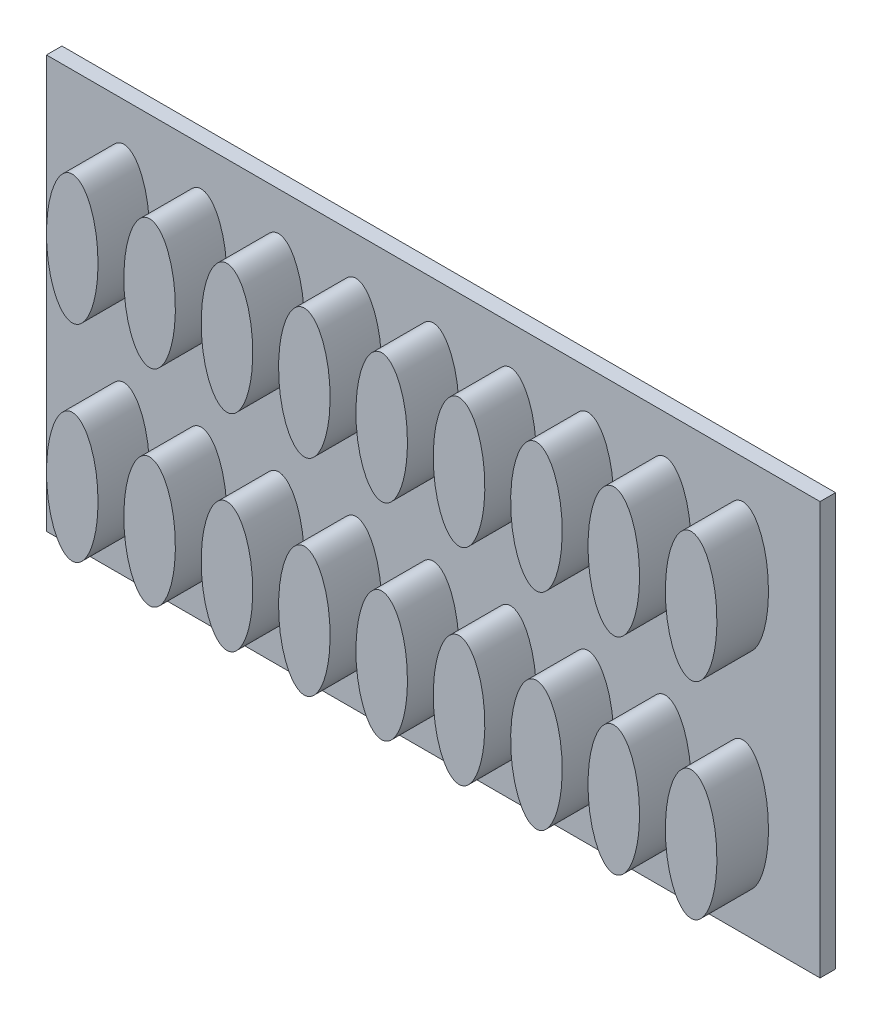
ISO-10303-21;
HEADER;
FILE_DESCRIPTION(('STEP AP214'),'2;1');
FILE_NAME('part.step','',(''),(''),'','','');
FILE_SCHEMA(('AUTOMOTIVE_DESIGN { 1 0 10303 214 1 1 1 1 }'));
ENDSEC;
DATA;
#1=APPLICATION_CONTEXT('core data for automotive mechanical design processes');
#2=APPLICATION_PROTOCOL_DEFINITION('international standard','automotive_design',2000,#1);
#3=PRODUCT_CONTEXT('',#1,'mechanical');
#4=PRODUCT('Part','Part','',(#3));
#5=PRODUCT_RELATED_PRODUCT_CATEGORY('part','',(#4));
#6=PRODUCT_DEFINITION_FORMATION('','',#4);
#7=PRODUCT_DEFINITION_CONTEXT('part definition',#1,'design');
#8=PRODUCT_DEFINITION('design','',#6,#7);
#9=PRODUCT_DEFINITION_SHAPE('','',#8);
#10=(LENGTH_UNIT() NAMED_UNIT(*) SI_UNIT(.MILLI.,.METRE.));
#11=(NAMED_UNIT(*) PLANE_ANGLE_UNIT() SI_UNIT($,.RADIAN.));
#12=(NAMED_UNIT(*) SI_UNIT($,.STERADIAN.) SOLID_ANGLE_UNIT());
#13=UNCERTAINTY_MEASURE_WITH_UNIT(LENGTH_MEASURE(1.E-05),#10,'distance_accuracy_value','');
#14=(GEOMETRIC_REPRESENTATION_CONTEXT(3) GLOBAL_UNCERTAINTY_ASSIGNED_CONTEXT((#13)) GLOBAL_UNIT_ASSIGNED_CONTEXT((#10,
#11,#12)) REPRESENTATION_CONTEXT('',''));
#15=CARTESIAN_POINT('',(0.,0.,0.));
#16=DIRECTION('',(0.,0.,1.));
#17=DIRECTION('',(1.,0.,0.));
#18=AXIS2_PLACEMENT_3D('',#15,#16,#17);
#19=CARTESIAN_POINT('',(0.,80.,3.));
#20=DIRECTION('',(0.,0.,-1.));
#21=DIRECTION('',(-1.,0.,0.));
#22=AXIS2_PLACEMENT_3D('',#19,#20,#21);
#23=PLANE('',#22);
#24=CARTESIAN_POINT('',(15.,60.,3.));
#25=DIRECTION('',(0.,0.,1.));
#26=DIRECTION('',(0.,1.,0.));
#27=AXIS2_PLACEMENT_3D('',#24,#25,#26);
#28=ELLIPSE('',#27,12.5,5.);
#29=CARTESIAN_POINT('',(15.,72.5,3.));
#30=VERTEX_POINT('',#29);
#31=EDGE_CURVE('E89',#30,#30,#28,.T.);
#32=ORIENTED_EDGE('',*,*,#31,.F.);
#33=EDGE_LOOP('',(#32));
#34=FACE_BOUND('',#33,.T.);
#35=DIRECTION('',(0.,-1.,0.));
#36=VECTOR('',#35,1.);
#37=CARTESIAN_POINT('',(0.,0.,3.));
#38=LINE('',#37,#36);
#39=CARTESIAN_POINT('',(0.,80.,3.));
#40=VERTEX_POINT('',#39);
#41=CARTESIAN_POINT('',(0.,0.,3.));
#42=VERTEX_POINT('',#41);
#43=EDGE_CURVE('E106',#40,#42,#38,.T.);
#44=ORIENTED_EDGE('',*,*,#43,.T.);
#45=DIRECTION('',(1.,0.,0.));
#46=VECTOR('',#45,1.);
#47=CARTESIAN_POINT('',(0.,0.,3.));
#48=LINE('',#47,#46);
#49=CARTESIAN_POINT('',(150.,0.,3.));
#50=VERTEX_POINT('',#49);
#51=EDGE_CURVE('E86',#42,#50,#48,.T.);
#52=ORIENTED_EDGE('',*,*,#51,.T.);
#53=DIRECTION('',(0.,1.,0.));
#54=VECTOR('',#53,1.);
#55=CARTESIAN_POINT('',(150.,0.,3.));
#56=LINE('',#55,#54);
#57=CARTESIAN_POINT('',(150.,80.,3.));
#58=VERTEX_POINT('',#57);
#59=EDGE_CURVE('E51',#50,#58,#56,.T.);
#60=ORIENTED_EDGE('',*,*,#59,.T.);
#61=DIRECTION('',(-1.,0.,0.));
#62=VECTOR('',#61,1.);
#63=CARTESIAN_POINT('',(0.,80.,3.));
#64=LINE('',#63,#62);
#65=EDGE_CURVE('E46',#58,#40,#64,.T.);
#66=ORIENTED_EDGE('',*,*,#65,.T.);
#67=EDGE_LOOP('',(#44,#52,#60,#66));
#68=FACE_BOUND('',#67,.T.);
#69=CARTESIAN_POINT('',(30.,60.,3.));
#70=DIRECTION('',(0.,0.,1.));
#71=DIRECTION('',(0.,1.,0.));
#72=AXIS2_PLACEMENT_3D('',#69,#70,#71);
#73=ELLIPSE('',#72,12.5,5.);
#74=CARTESIAN_POINT('',(30.,72.5,3.));
#75=VERTEX_POINT('',#74);
#76=EDGE_CURVE('E118',#75,#75,#73,.T.);
#77=ORIENTED_EDGE('',*,*,#76,.F.);
#78=EDGE_LOOP('',(#77));
#79=FACE_BOUND('',#78,.T.);
#80=CARTESIAN_POINT('',(45.,60.,3.));
#81=DIRECTION('',(0.,0.,1.));
#82=DIRECTION('',(0.,1.,0.));
#83=AXIS2_PLACEMENT_3D('',#80,#81,#82);
#84=ELLIPSE('',#83,12.5,5.);
#85=CARTESIAN_POINT('',(45.,72.5,3.));
#86=VERTEX_POINT('',#85);
#87=EDGE_CURVE('E121',#86,#86,#84,.T.);
#88=ORIENTED_EDGE('',*,*,#87,.F.);
#89=EDGE_LOOP('',(#88));
#90=FACE_BOUND('',#89,.T.);
#91=CARTESIAN_POINT('',(60.,60.,3.));
#92=DIRECTION('',(0.,0.,1.));
#93=DIRECTION('',(0.,1.,0.));
#94=AXIS2_PLACEMENT_3D('',#91,#92,#93);
#95=ELLIPSE('',#94,12.5,5.);
#96=CARTESIAN_POINT('',(60.,72.5,3.));
#97=VERTEX_POINT('',#96);
#98=EDGE_CURVE('E126',#97,#97,#95,.T.);
#99=ORIENTED_EDGE('',*,*,#98,.F.);
#100=EDGE_LOOP('',(#99));
#101=FACE_BOUND('',#100,.T.);
#102=CARTESIAN_POINT('',(75.,60.,3.));
#103=DIRECTION('',(0.,0.,1.));
#104=DIRECTION('',(0.,1.,0.));
#105=AXIS2_PLACEMENT_3D('',#102,#103,#104);
#106=ELLIPSE('',#105,12.5,5.);
#107=CARTESIAN_POINT('',(75.,72.5,3.));
#108=VERTEX_POINT('',#107);
#109=EDGE_CURVE('E152',#108,#108,#106,.T.);
#110=ORIENTED_EDGE('',*,*,#109,.F.);
#111=EDGE_LOOP('',(#110));
#112=FACE_BOUND('',#111,.T.);
#113=CARTESIAN_POINT('',(90.,60.,3.));
#114=DIRECTION('',(0.,0.,1.));
#115=DIRECTION('',(0.,1.,0.));
#116=AXIS2_PLACEMENT_3D('',#113,#114,#115);
#117=ELLIPSE('',#116,12.5,5.);
#118=CARTESIAN_POINT('',(90.,72.5,3.));
#119=VERTEX_POINT('',#118);
#120=EDGE_CURVE('E159',#119,#119,#117,.T.);
#121=ORIENTED_EDGE('',*,*,#120,.F.);
#122=EDGE_LOOP('',(#121));
#123=FACE_BOUND('',#122,.T.);
#124=CARTESIAN_POINT('',(105.,60.,3.));
#125=DIRECTION('',(0.,0.,1.));
#126=DIRECTION('',(0.,1.,0.));
#127=AXIS2_PLACEMENT_3D('',#124,#125,#126);
#128=ELLIPSE('',#127,12.5,5.);
#129=CARTESIAN_POINT('',(105.,72.5,3.));
#130=VERTEX_POINT('',#129);
#131=EDGE_CURVE('E179',#130,#130,#128,.T.);
#132=ORIENTED_EDGE('',*,*,#131,.F.);
#133=EDGE_LOOP('',(#132));
#134=FACE_BOUND('',#133,.T.);
#135=CARTESIAN_POINT('',(120.,60.,3.));
#136=DIRECTION('',(0.,0.,1.));
#137=DIRECTION('',(0.,1.,0.));
#138=AXIS2_PLACEMENT_3D('',#135,#136,#137);
#139=ELLIPSE('',#138,12.5,5.);
#140=CARTESIAN_POINT('',(120.,72.5,3.));
#141=VERTEX_POINT('',#140);
#142=EDGE_CURVE('E186',#141,#141,#139,.T.);
#143=ORIENTED_EDGE('',*,*,#142,.F.);
#144=EDGE_LOOP('',(#143));
#145=FACE_BOUND('',#144,.T.);
#146=CARTESIAN_POINT('',(135.,60.,3.));
#147=DIRECTION('',(0.,0.,1.));
#148=DIRECTION('',(0.,1.,0.));
#149=AXIS2_PLACEMENT_3D('',#146,#147,#148);
#150=ELLIPSE('',#149,12.5,5.);
#151=CARTESIAN_POINT('',(135.,72.5,3.));
#152=VERTEX_POINT('',#151);
#153=EDGE_CURVE('E206',#152,#152,#150,.T.);
#154=ORIENTED_EDGE('',*,*,#153,.F.);
#155=EDGE_LOOP('',(#154));
#156=FACE_BOUND('',#155,.T.);
#157=CARTESIAN_POINT('',(15.,20.,3.));
#158=DIRECTION('',(0.,0.,1.));
#159=DIRECTION('',(0.,1.,0.));
#160=AXIS2_PLACEMENT_3D('',#157,#158,#159);
#161=ELLIPSE('',#160,12.5,5.);
#162=CARTESIAN_POINT('',(15.,32.5,3.));
#163=VERTEX_POINT('',#162);
#164=EDGE_CURVE('E213',#163,#163,#161,.T.);
#165=ORIENTED_EDGE('',*,*,#164,.F.);
#166=EDGE_LOOP('',(#165));
#167=FACE_BOUND('',#166,.T.);
#168=CARTESIAN_POINT('',(30.,20.,3.));
#169=DIRECTION('',(0.,0.,1.));
#170=DIRECTION('',(0.,1.,0.));
#171=AXIS2_PLACEMENT_3D('',#168,#169,#170);
#172=ELLIPSE('',#171,12.5,5.);
#173=CARTESIAN_POINT('',(30.,32.5,3.));
#174=VERTEX_POINT('',#173);
#175=EDGE_CURVE('E233',#174,#174,#172,.T.);
#176=ORIENTED_EDGE('',*,*,#175,.F.);
#177=EDGE_LOOP('',(#176));
#178=FACE_BOUND('',#177,.T.);
#179=CARTESIAN_POINT('',(45.,20.,3.));
#180=DIRECTION('',(0.,0.,1.));
#181=DIRECTION('',(0.,1.,0.));
#182=AXIS2_PLACEMENT_3D('',#179,#180,#181);
#183=ELLIPSE('',#182,12.5,5.);
#184=CARTESIAN_POINT('',(45.,32.5,3.));
#185=VERTEX_POINT('',#184);
#186=EDGE_CURVE('E240',#185,#185,#183,.T.);
#187=ORIENTED_EDGE('',*,*,#186,.F.);
#188=EDGE_LOOP('',(#187));
#189=FACE_BOUND('',#188,.T.);
#190=CARTESIAN_POINT('',(60.,20.,3.));
#191=DIRECTION('',(0.,0.,1.));
#192=DIRECTION('',(0.,1.,0.));
#193=AXIS2_PLACEMENT_3D('',#190,#191,#192);
#194=ELLIPSE('',#193,12.5,5.);
#195=CARTESIAN_POINT('',(60.,32.5,3.));
#196=VERTEX_POINT('',#195);
#197=EDGE_CURVE('E260',#196,#196,#194,.T.);
#198=ORIENTED_EDGE('',*,*,#197,.F.);
#199=EDGE_LOOP('',(#198));
#200=FACE_BOUND('',#199,.T.);
#201=CARTESIAN_POINT('',(75.,20.,3.));
#202=DIRECTION('',(0.,0.,1.));
#203=DIRECTION('',(0.,1.,0.));
#204=AXIS2_PLACEMENT_3D('',#201,#202,#203);
#205=ELLIPSE('',#204,12.5,5.);
#206=CARTESIAN_POINT('',(75.,32.5,3.));
#207=VERTEX_POINT('',#206);
#208=EDGE_CURVE('E267',#207,#207,#205,.T.);
#209=ORIENTED_EDGE('',*,*,#208,.F.);
#210=EDGE_LOOP('',(#209));
#211=FACE_BOUND('',#210,.T.);
#212=CARTESIAN_POINT('',(90.,20.,3.));
#213=DIRECTION('',(0.,0.,1.));
#214=DIRECTION('',(0.,1.,0.));
#215=AXIS2_PLACEMENT_3D('',#212,#213,#214);
#216=ELLIPSE('',#215,12.5,5.);
#217=CARTESIAN_POINT('',(90.,32.5,3.));
#218=VERTEX_POINT('',#217);
#219=EDGE_CURVE('E287',#218,#218,#216,.T.);
#220=ORIENTED_EDGE('',*,*,#219,.F.);
#221=EDGE_LOOP('',(#220));
#222=FACE_BOUND('',#221,.T.);
#223=CARTESIAN_POINT('',(105.,20.,3.));
#224=DIRECTION('',(0.,0.,1.));
#225=DIRECTION('',(0.,1.,0.));
#226=AXIS2_PLACEMENT_3D('',#223,#224,#225);
#227=ELLIPSE('',#226,12.5,5.);
#228=CARTESIAN_POINT('',(105.,32.5,3.));
#229=VERTEX_POINT('',#228);
#230=EDGE_CURVE('E294',#229,#229,#227,.T.);
#231=ORIENTED_EDGE('',*,*,#230,.F.);
#232=EDGE_LOOP('',(#231));
#233=FACE_BOUND('',#232,.T.);
#234=CARTESIAN_POINT('',(120.,20.,3.));
#235=DIRECTION('',(0.,0.,1.));
#236=DIRECTION('',(0.,1.,0.));
#237=AXIS2_PLACEMENT_3D('',#234,#235,#236);
#238=ELLIPSE('',#237,12.5,5.);
#239=CARTESIAN_POINT('',(120.,32.5,3.));
#240=VERTEX_POINT('',#239);
#241=EDGE_CURVE('E314',#240,#240,#238,.T.);
#242=ORIENTED_EDGE('',*,*,#241,.F.);
#243=EDGE_LOOP('',(#242));
#244=FACE_BOUND('',#243,.T.);
#245=CARTESIAN_POINT('',(135.,20.,3.));
#246=DIRECTION('',(0.,0.,1.));
#247=DIRECTION('',(0.,1.,0.));
#248=AXIS2_PLACEMENT_3D('',#245,#246,#247);
#249=ELLIPSE('',#248,12.5,5.);
#250=CARTESIAN_POINT('',(135.,32.5,3.));
#251=VERTEX_POINT('',#250);
#252=EDGE_CURVE('E35',#251,#251,#249,.T.);
#253=ORIENTED_EDGE('',*,*,#252,.F.);
#254=EDGE_LOOP('',(#253));
#255=FACE_BOUND('',#254,.T.);
#256=ADVANCED_FACE('F31',(#34,#68,#79,#90,#101,#112,#123,#134,#145,#156,#167,#178,#189,#200,
#211,#222,#233,#244,#255),#23,.F.);
#257=CARTESIAN_POINT('',(0.,0.,3.));
#258=DIRECTION('',(1.,0.,0.));
#259=DIRECTION('',(0.,0.,-1.));
#260=AXIS2_PLACEMENT_3D('',#257,#258,#259);
#261=PLANE('',#260);
#262=DIRECTION('',(0.,-1.,0.));
#263=VECTOR('',#262,1.);
#264=CARTESIAN_POINT('',(0.,0.,0.));
#265=LINE('',#264,#263);
#266=CARTESIAN_POINT('',(0.,80.,0.));
#267=VERTEX_POINT('',#266);
#268=CARTESIAN_POINT('',(0.,0.,0.));
#269=VERTEX_POINT('',#268);
#270=EDGE_CURVE('E77',#267,#269,#265,.T.);
#271=ORIENTED_EDGE('',*,*,#270,.T.);
#272=DIRECTION('',(0.,0.,-1.));
#273=VECTOR('',#272,1.);
#274=CARTESIAN_POINT('',(0.,0.,3.));
#275=LINE('',#274,#273);
#276=EDGE_CURVE('E84',#42,#269,#275,.T.);
#277=ORIENTED_EDGE('',*,*,#276,.F.);
#278=ORIENTED_EDGE('',*,*,#43,.F.);
#279=DIRECTION('',(0.,0.,-1.));
#280=VECTOR('',#279,1.);
#281=CARTESIAN_POINT('',(0.,80.,3.));
#282=LINE('',#281,#280);
#283=EDGE_CURVE('E94',#40,#267,#282,.T.);
#284=ORIENTED_EDGE('',*,*,#283,.T.);
#285=EDGE_LOOP('',(#271,#277,#278,#284));
#286=FACE_BOUND('',#285,.T.);
#287=ADVANCED_FACE('F93',(#286),#261,.F.);
#288=CARTESIAN_POINT('',(0.,0.,3.));
#289=DIRECTION('',(0.,1.,0.));
#290=DIRECTION('',(0.,0.,1.));
#291=AXIS2_PLACEMENT_3D('',#288,#289,#290);
#292=PLANE('',#291);
#293=DIRECTION('',(1.,0.,0.));
#294=VECTOR('',#293,1.);
#295=CARTESIAN_POINT('',(0.,0.,0.));
#296=LINE('',#295,#294);
#297=CARTESIAN_POINT('',(150.,0.,0.));
#298=VERTEX_POINT('',#297);
#299=EDGE_CURVE('E72',#269,#298,#296,.T.);
#300=ORIENTED_EDGE('',*,*,#299,.T.);
#301=DIRECTION('',(0.,0.,-1.));
#302=VECTOR('',#301,1.);
#303=CARTESIAN_POINT('',(150.,0.,3.));
#304=LINE('',#303,#302);
#305=EDGE_CURVE('E90',#50,#298,#304,.T.);
#306=ORIENTED_EDGE('',*,*,#305,.F.);
#307=ORIENTED_EDGE('',*,*,#51,.F.);
#308=ORIENTED_EDGE('',*,*,#276,.T.);
#309=EDGE_LOOP('',(#300,#306,#307,#308));
#310=FACE_BOUND('',#309,.T.);
#311=ADVANCED_FACE('F85',(#310),#292,.F.);
#312=CARTESIAN_POINT('',(150.,0.,3.));
#313=DIRECTION('',(-1.,0.,0.));
#314=DIRECTION('',(0.,0.,1.));
#315=AXIS2_PLACEMENT_3D('',#312,#313,#314);
#316=PLANE('',#315);
#317=DIRECTION('',(0.,1.,0.));
#318=VECTOR('',#317,1.);
#319=CARTESIAN_POINT('',(150.,0.,0.));
#320=LINE('',#319,#318);
#321=CARTESIAN_POINT('',(150.,80.,0.));
#322=VERTEX_POINT('',#321);
#323=EDGE_CURVE('E78',#298,#322,#320,.T.);
#324=ORIENTED_EDGE('',*,*,#323,.T.);
#325=DIRECTION('',(0.,0.,-1.));
#326=VECTOR('',#325,1.);
#327=CARTESIAN_POINT('',(150.,80.,3.));
#328=LINE('',#327,#326);
#329=EDGE_CURVE('E112',#58,#322,#328,.T.);
#330=ORIENTED_EDGE('',*,*,#329,.F.);
#331=ORIENTED_EDGE('',*,*,#59,.F.);
#332=ORIENTED_EDGE('',*,*,#305,.T.);
#333=EDGE_LOOP('',(#324,#330,#331,#332));
#334=FACE_BOUND('',#333,.T.);
#335=ADVANCED_FACE('F350',(#334),#316,.F.);
#336=CARTESIAN_POINT('',(0.,80.,3.));
#337=DIRECTION('',(0.,-1.,0.));
#338=DIRECTION('',(0.,0.,-1.));
#339=AXIS2_PLACEMENT_3D('',#336,#337,#338);
#340=PLANE('',#339);
#341=DIRECTION('',(-1.,0.,0.));
#342=VECTOR('',#341,1.);
#343=CARTESIAN_POINT('',(0.,80.,0.));
#344=LINE('',#343,#342);
#345=EDGE_CURVE('E104',#322,#267,#344,.T.);
#346=ORIENTED_EDGE('',*,*,#345,.T.);
#347=ORIENTED_EDGE('',*,*,#283,.F.);
#348=ORIENTED_EDGE('',*,*,#65,.F.);
#349=ORIENTED_EDGE('',*,*,#329,.T.);
#350=EDGE_LOOP('',(#346,#347,#348,#349));
#351=FACE_BOUND('',#350,.T.);
#352=ADVANCED_FACE('F347',(#351),#340,.F.);
#353=CARTESIAN_POINT('',(0.,80.,0.));
#354=DIRECTION('',(0.,0.,-1.));
#355=DIRECTION('',(-1.,0.,0.));
#356=AXIS2_PLACEMENT_3D('',#353,#354,#355);
#357=PLANE('',#356);
#358=ORIENTED_EDGE('',*,*,#270,.F.);
#359=ORIENTED_EDGE('',*,*,#345,.F.);
#360=ORIENTED_EDGE('',*,*,#323,.F.);
#361=ORIENTED_EDGE('',*,*,#299,.F.);
#362=EDGE_LOOP('',(#358,#359,#360,#361));
#363=FACE_BOUND('',#362,.T.);
#364=ADVANCED_FACE('F74',(#363),#357,.T.);
#365=CARTESIAN_POINT('',(15.,60.,13.));
#366=DIRECTION('',(0.,0.,1.));
#367=DIRECTION('',(0.,1.,0.));
#368=AXIS2_PLACEMENT_3D('',#365,#366,#367);
#369=ELLIPSE('',#368,12.5,5.);
#370=DIRECTION('',(0.,0.,-1.));
#371=VECTOR('',#370,1.);
#372=SURFACE_OF_LINEAR_EXTRUSION('',#369,#371);
#373=CARTESIAN_POINT('',(15.,72.5,13.));
#374=VERTEX_POINT('',#373);
#375=EDGE_CURVE('E95',#374,#374,#369,.T.);
#376=ORIENTED_EDGE('',*,*,#375,.F.);
#377=EDGE_LOOP('',(#376));
#378=FACE_BOUND('',#377,.T.);
#379=ORIENTED_EDGE('',*,*,#31,.T.);
#380=EDGE_LOOP('',(#379));
#381=FACE_BOUND('',#380,.T.);
#382=ADVANCED_FACE('F373',(#378,#381),#372,.F.);
#383=CARTESIAN_POINT('',(15.,60.,13.));
#384=DIRECTION('',(0.,0.,1.));
#385=DIRECTION('',(1.,0.,0.));
#386=AXIS2_PLACEMENT_3D('',#383,#384,#385);
#387=PLANE('',#386);
#388=ORIENTED_EDGE('',*,*,#375,.T.);
#389=EDGE_LOOP('',(#388));
#390=FACE_BOUND('',#389,.T.);
#391=ADVANCED_FACE('F379',(#390),#387,.T.);
#392=CARTESIAN_POINT('',(30.,60.,13.));
#393=DIRECTION('',(0.,0.,1.));
#394=DIRECTION('',(0.,1.,0.));
#395=AXIS2_PLACEMENT_3D('',#392,#393,#394);
#396=ELLIPSE('',#395,12.5,5.);
#397=DIRECTION('',(0.,0.,-1.));
#398=VECTOR('',#397,1.);
#399=SURFACE_OF_LINEAR_EXTRUSION('',#396,#398);
#400=CARTESIAN_POINT('',(30.,72.5,13.));
#401=VERTEX_POINT('',#400);
#402=EDGE_CURVE('E98',#401,#401,#396,.T.);
#403=ORIENTED_EDGE('',*,*,#402,.F.);
#404=EDGE_LOOP('',(#403));
#405=FACE_BOUND('',#404,.T.);
#406=ORIENTED_EDGE('',*,*,#76,.T.);
#407=EDGE_LOOP('',(#406));
#408=FACE_BOUND('',#407,.T.);
#409=ADVANCED_FACE('F141',(#405,#408),#399,.F.);
#410=CARTESIAN_POINT('',(30.,60.,13.));
#411=DIRECTION('',(0.,0.,1.));
#412=DIRECTION('',(1.,0.,0.));
#413=AXIS2_PLACEMENT_3D('',#410,#411,#412);
#414=PLANE('',#413);
#415=ORIENTED_EDGE('',*,*,#402,.T.);
#416=EDGE_LOOP('',(#415));
#417=FACE_BOUND('',#416,.T.);
#418=ADVANCED_FACE('F139',(#417),#414,.T.);
#419=CARTESIAN_POINT('',(45.,60.,13.));
#420=DIRECTION('',(0.,0.,1.));
#421=DIRECTION('',(1.,0.,0.));
#422=AXIS2_PLACEMENT_3D('',#419,#420,#421);
#423=PLANE('',#422);
#424=CARTESIAN_POINT('',(45.,60.,13.));
#425=DIRECTION('',(0.,0.,1.));
#426=DIRECTION('',(0.,1.,0.));
#427=AXIS2_PLACEMENT_3D('',#424,#425,#426);
#428=ELLIPSE('',#427,12.5,5.);
#429=CARTESIAN_POINT('',(45.,72.5,13.));
#430=VERTEX_POINT('',#429);
#431=EDGE_CURVE('E122',#430,#430,#428,.T.);
#432=ORIENTED_EDGE('',*,*,#431,.T.);
#433=EDGE_LOOP('',(#432));
#434=FACE_BOUND('',#433,.T.);
#435=ADVANCED_FACE('F134',(#434),#423,.T.);
#436=DIRECTION('',(0.,0.,-1.));
#437=VECTOR('',#436,1.);
#438=SURFACE_OF_LINEAR_EXTRUSION('',#428,#437);
#439=ORIENTED_EDGE('',*,*,#431,.F.);
#440=EDGE_LOOP('',(#439));
#441=FACE_BOUND('',#440,.T.);
#442=ORIENTED_EDGE('',*,*,#87,.T.);
#443=EDGE_LOOP('',(#442));
#444=FACE_BOUND('',#443,.T.);
#445=ADVANCED_FACE('F129',(#441,#444),#438,.F.);
#446=CARTESIAN_POINT('',(60.,60.,13.));
#447=DIRECTION('',(0.,0.,1.));
#448=DIRECTION('',(1.,0.,0.));
#449=AXIS2_PLACEMENT_3D('',#446,#447,#448);
#450=PLANE('',#449);
#451=CARTESIAN_POINT('',(60.,60.,13.));
#452=DIRECTION('',(0.,0.,1.));
#453=DIRECTION('',(0.,1.,0.));
#454=AXIS2_PLACEMENT_3D('',#451,#452,#453);
#455=ELLIPSE('',#454,12.5,5.);
#456=CARTESIAN_POINT('',(60.,72.5,13.));
#457=VERTEX_POINT('',#456);
#458=EDGE_CURVE('E148',#457,#457,#455,.T.);
#459=ORIENTED_EDGE('',*,*,#458,.T.);
#460=EDGE_LOOP('',(#459));
#461=FACE_BOUND('',#460,.T.);
#462=ADVANCED_FACE('F133',(#461),#450,.T.);
#463=DIRECTION('',(0.,0.,-1.));
#464=VECTOR('',#463,1.);
#465=SURFACE_OF_LINEAR_EXTRUSION('',#455,#464);
#466=ORIENTED_EDGE('',*,*,#458,.F.);
#467=EDGE_LOOP('',(#466));
#468=FACE_BOUND('',#467,.T.);
#469=ORIENTED_EDGE('',*,*,#98,.T.);
#470=EDGE_LOOP('',(#469));
#471=FACE_BOUND('',#470,.T.);
#472=ADVANCED_FACE('F142',(#468,#471),#465,.F.);
#473=CARTESIAN_POINT('',(75.,60.,13.));
#474=DIRECTION('',(0.,0.,1.));
#475=DIRECTION('',(1.,0.,0.));
#476=AXIS2_PLACEMENT_3D('',#473,#474,#475);
#477=PLANE('',#476);
#478=CARTESIAN_POINT('',(75.,60.,13.));
#479=DIRECTION('',(0.,0.,1.));
#480=DIRECTION('',(0.,1.,0.));
#481=AXIS2_PLACEMENT_3D('',#478,#479,#480);
#482=ELLIPSE('',#481,12.5,5.);
#483=CARTESIAN_POINT('',(75.,72.5,13.));
#484=VERTEX_POINT('',#483);
#485=EDGE_CURVE('E155',#484,#484,#482,.T.);
#486=ORIENTED_EDGE('',*,*,#485,.T.);
#487=EDGE_LOOP('',(#486));
#488=FACE_BOUND('',#487,.T.);
#489=ADVANCED_FACE('F145',(#488),#477,.T.);
#490=DIRECTION('',(0.,0.,-1.));
#491=VECTOR('',#490,1.);
#492=SURFACE_OF_LINEAR_EXTRUSION('',#482,#491);
#493=ORIENTED_EDGE('',*,*,#485,.F.);
#494=EDGE_LOOP('',(#493));
#495=FACE_BOUND('',#494,.T.);
#496=ORIENTED_EDGE('',*,*,#109,.T.);
#497=EDGE_LOOP('',(#496));
#498=FACE_BOUND('',#497,.T.);
#499=ADVANCED_FACE('F161',(#495,#498),#492,.F.);
#500=CARTESIAN_POINT('',(90.,60.,13.));
#501=DIRECTION('',(0.,0.,1.));
#502=DIRECTION('',(1.,0.,0.));
#503=AXIS2_PLACEMENT_3D('',#500,#501,#502);
#504=PLANE('',#503);
#505=CARTESIAN_POINT('',(90.,60.,13.));
#506=DIRECTION('',(0.,0.,1.));
#507=DIRECTION('',(0.,1.,0.));
#508=AXIS2_PLACEMENT_3D('',#505,#506,#507);
#509=ELLIPSE('',#508,12.5,5.);
#510=CARTESIAN_POINT('',(90.,72.5,13.));
#511=VERTEX_POINT('',#510);
#512=EDGE_CURVE('E175',#511,#511,#509,.T.);
#513=ORIENTED_EDGE('',*,*,#512,.T.);
#514=EDGE_LOOP('',(#513));
#515=FACE_BOUND('',#514,.T.);
#516=ADVANCED_FACE('F164',(#515),#504,.T.);
#517=DIRECTION('',(0.,0.,-1.));
#518=VECTOR('',#517,1.);
#519=SURFACE_OF_LINEAR_EXTRUSION('',#509,#518);
#520=ORIENTED_EDGE('',*,*,#512,.F.);
#521=EDGE_LOOP('',(#520));
#522=FACE_BOUND('',#521,.T.);
#523=ORIENTED_EDGE('',*,*,#120,.T.);
#524=EDGE_LOOP('',(#523));
#525=FACE_BOUND('',#524,.T.);
#526=ADVANCED_FACE('F169',(#522,#525),#519,.F.);
#527=CARTESIAN_POINT('',(105.,60.,13.));
#528=DIRECTION('',(0.,0.,1.));
#529=DIRECTION('',(1.,0.,0.));
#530=AXIS2_PLACEMENT_3D('',#527,#528,#529);
#531=PLANE('',#530);
#532=CARTESIAN_POINT('',(105.,60.,13.));
#533=DIRECTION('',(0.,0.,1.));
#534=DIRECTION('',(0.,1.,0.));
#535=AXIS2_PLACEMENT_3D('',#532,#533,#534);
#536=ELLIPSE('',#535,12.5,5.);
#537=CARTESIAN_POINT('',(105.,72.5,13.));
#538=VERTEX_POINT('',#537);
#539=EDGE_CURVE('E182',#538,#538,#536,.T.);
#540=ORIENTED_EDGE('',*,*,#539,.T.);
#541=EDGE_LOOP('',(#540));
#542=FACE_BOUND('',#541,.T.);
#543=ADVANCED_FACE('F172',(#542),#531,.T.);
#544=DIRECTION('',(0.,0.,-1.));
#545=VECTOR('',#544,1.);
#546=SURFACE_OF_LINEAR_EXTRUSION('',#536,#545);
#547=ORIENTED_EDGE('',*,*,#539,.F.);
#548=EDGE_LOOP('',(#547));
#549=FACE_BOUND('',#548,.T.);
#550=ORIENTED_EDGE('',*,*,#131,.T.);
#551=EDGE_LOOP('',(#550));
#552=FACE_BOUND('',#551,.T.);
#553=ADVANCED_FACE('F188',(#549,#552),#546,.F.);
#554=CARTESIAN_POINT('',(120.,60.,13.));
#555=DIRECTION('',(0.,0.,1.));
#556=DIRECTION('',(1.,0.,0.));
#557=AXIS2_PLACEMENT_3D('',#554,#555,#556);
#558=PLANE('',#557);
#559=CARTESIAN_POINT('',(120.,60.,13.));
#560=DIRECTION('',(0.,0.,1.));
#561=DIRECTION('',(0.,1.,0.));
#562=AXIS2_PLACEMENT_3D('',#559,#560,#561);
#563=ELLIPSE('',#562,12.5,5.);
#564=CARTESIAN_POINT('',(120.,72.5,13.));
#565=VERTEX_POINT('',#564);
#566=EDGE_CURVE('E202',#565,#565,#563,.T.);
#567=ORIENTED_EDGE('',*,*,#566,.T.);
#568=EDGE_LOOP('',(#567));
#569=FACE_BOUND('',#568,.T.);
#570=ADVANCED_FACE('F191',(#569),#558,.T.);
#571=DIRECTION('',(0.,0.,-1.));
#572=VECTOR('',#571,1.);
#573=SURFACE_OF_LINEAR_EXTRUSION('',#563,#572);
#574=ORIENTED_EDGE('',*,*,#566,.F.);
#575=EDGE_LOOP('',(#574));
#576=FACE_BOUND('',#575,.T.);
#577=ORIENTED_EDGE('',*,*,#142,.T.);
#578=EDGE_LOOP('',(#577));
#579=FACE_BOUND('',#578,.T.);
#580=ADVANCED_FACE('F196',(#576,#579),#573,.F.);
#581=CARTESIAN_POINT('',(135.,60.,13.));
#582=DIRECTION('',(0.,0.,1.));
#583=DIRECTION('',(1.,0.,0.));
#584=AXIS2_PLACEMENT_3D('',#581,#582,#583);
#585=PLANE('',#584);
#586=CARTESIAN_POINT('',(135.,60.,13.));
#587=DIRECTION('',(0.,0.,1.));
#588=DIRECTION('',(0.,1.,0.));
#589=AXIS2_PLACEMENT_3D('',#586,#587,#588);
#590=ELLIPSE('',#589,12.5,5.);
#591=CARTESIAN_POINT('',(135.,72.5,13.));
#592=VERTEX_POINT('',#591);
#593=EDGE_CURVE('E209',#592,#592,#590,.T.);
#594=ORIENTED_EDGE('',*,*,#593,.T.);
#595=EDGE_LOOP('',(#594));
#596=FACE_BOUND('',#595,.T.);
#597=ADVANCED_FACE('F199',(#596),#585,.T.);
#598=DIRECTION('',(0.,0.,-1.));
#599=VECTOR('',#598,1.);
#600=SURFACE_OF_LINEAR_EXTRUSION('',#590,#599);
#601=ORIENTED_EDGE('',*,*,#593,.F.);
#602=EDGE_LOOP('',(#601));
#603=FACE_BOUND('',#602,.T.);
#604=ORIENTED_EDGE('',*,*,#153,.T.);
#605=EDGE_LOOP('',(#604));
#606=FACE_BOUND('',#605,.T.);
#607=ADVANCED_FACE('F215',(#603,#606),#600,.F.);
#608=CARTESIAN_POINT('',(15.,20.,13.));
#609=DIRECTION('',(0.,0.,1.));
#610=DIRECTION('',(1.,0.,0.));
#611=AXIS2_PLACEMENT_3D('',#608,#609,#610);
#612=PLANE('',#611);
#613=CARTESIAN_POINT('',(15.,20.,13.));
#614=DIRECTION('',(0.,0.,1.));
#615=DIRECTION('',(0.,1.,0.));
#616=AXIS2_PLACEMENT_3D('',#613,#614,#615);
#617=ELLIPSE('',#616,12.5,5.);
#618=CARTESIAN_POINT('',(15.,32.5,13.));
#619=VERTEX_POINT('',#618);
#620=EDGE_CURVE('E229',#619,#619,#617,.T.);
#621=ORIENTED_EDGE('',*,*,#620,.T.);
#622=EDGE_LOOP('',(#621));
#623=FACE_BOUND('',#622,.T.);
#624=ADVANCED_FACE('F218',(#623),#612,.T.);
#625=DIRECTION('',(0.,0.,-1.));
#626=VECTOR('',#625,1.);
#627=SURFACE_OF_LINEAR_EXTRUSION('',#617,#626);
#628=ORIENTED_EDGE('',*,*,#620,.F.);
#629=EDGE_LOOP('',(#628));
#630=FACE_BOUND('',#629,.T.);
#631=ORIENTED_EDGE('',*,*,#164,.T.);
#632=EDGE_LOOP('',(#631));
#633=FACE_BOUND('',#632,.T.);
#634=ADVANCED_FACE('F223',(#630,#633),#627,.F.);
#635=CARTESIAN_POINT('',(30.,20.,13.));
#636=DIRECTION('',(0.,0.,1.));
#637=DIRECTION('',(1.,0.,0.));
#638=AXIS2_PLACEMENT_3D('',#635,#636,#637);
#639=PLANE('',#638);
#640=CARTESIAN_POINT('',(30.,20.,13.));
#641=DIRECTION('',(0.,0.,1.));
#642=DIRECTION('',(0.,1.,0.));
#643=AXIS2_PLACEMENT_3D('',#640,#641,#642);
#644=ELLIPSE('',#643,12.5,5.);
#645=CARTESIAN_POINT('',(30.,32.5,13.));
#646=VERTEX_POINT('',#645);
#647=EDGE_CURVE('E236',#646,#646,#644,.T.);
#648=ORIENTED_EDGE('',*,*,#647,.T.);
#649=EDGE_LOOP('',(#648));
#650=FACE_BOUND('',#649,.T.);
#651=ADVANCED_FACE('F226',(#650),#639,.T.);
#652=DIRECTION('',(0.,0.,-1.));
#653=VECTOR('',#652,1.);
#654=SURFACE_OF_LINEAR_EXTRUSION('',#644,#653);
#655=ORIENTED_EDGE('',*,*,#647,.F.);
#656=EDGE_LOOP('',(#655));
#657=FACE_BOUND('',#656,.T.);
#658=ORIENTED_EDGE('',*,*,#175,.T.);
#659=EDGE_LOOP('',(#658));
#660=FACE_BOUND('',#659,.T.);
#661=ADVANCED_FACE('F242',(#657,#660),#654,.F.);
#662=CARTESIAN_POINT('',(45.,20.,13.));
#663=DIRECTION('',(0.,0.,1.));
#664=DIRECTION('',(1.,0.,0.));
#665=AXIS2_PLACEMENT_3D('',#662,#663,#664);
#666=PLANE('',#665);
#667=CARTESIAN_POINT('',(45.,20.,13.));
#668=DIRECTION('',(0.,0.,1.));
#669=DIRECTION('',(0.,1.,0.));
#670=AXIS2_PLACEMENT_3D('',#667,#668,#669);
#671=ELLIPSE('',#670,12.5,5.);
#672=CARTESIAN_POINT('',(45.,32.5,13.));
#673=VERTEX_POINT('',#672);
#674=EDGE_CURVE('E256',#673,#673,#671,.T.);
#675=ORIENTED_EDGE('',*,*,#674,.T.);
#676=EDGE_LOOP('',(#675));
#677=FACE_BOUND('',#676,.T.);
#678=ADVANCED_FACE('F245',(#677),#666,.T.);
#679=DIRECTION('',(0.,0.,-1.));
#680=VECTOR('',#679,1.);
#681=SURFACE_OF_LINEAR_EXTRUSION('',#671,#680);
#682=ORIENTED_EDGE('',*,*,#674,.F.);
#683=EDGE_LOOP('',(#682));
#684=FACE_BOUND('',#683,.T.);
#685=ORIENTED_EDGE('',*,*,#186,.T.);
#686=EDGE_LOOP('',(#685));
#687=FACE_BOUND('',#686,.T.);
#688=ADVANCED_FACE('F250',(#684,#687),#681,.F.);
#689=CARTESIAN_POINT('',(60.,20.,13.));
#690=DIRECTION('',(0.,0.,1.));
#691=DIRECTION('',(1.,0.,0.));
#692=AXIS2_PLACEMENT_3D('',#689,#690,#691);
#693=PLANE('',#692);
#694=CARTESIAN_POINT('',(60.,20.,13.));
#695=DIRECTION('',(0.,0.,1.));
#696=DIRECTION('',(0.,1.,0.));
#697=AXIS2_PLACEMENT_3D('',#694,#695,#696);
#698=ELLIPSE('',#697,12.5,5.);
#699=CARTESIAN_POINT('',(60.,32.5,13.));
#700=VERTEX_POINT('',#699);
#701=EDGE_CURVE('E263',#700,#700,#698,.T.);
#702=ORIENTED_EDGE('',*,*,#701,.T.);
#703=EDGE_LOOP('',(#702));
#704=FACE_BOUND('',#703,.T.);
#705=ADVANCED_FACE('F253',(#704),#693,.T.);
#706=DIRECTION('',(0.,0.,-1.));
#707=VECTOR('',#706,1.);
#708=SURFACE_OF_LINEAR_EXTRUSION('',#698,#707);
#709=ORIENTED_EDGE('',*,*,#701,.F.);
#710=EDGE_LOOP('',(#709));
#711=FACE_BOUND('',#710,.T.);
#712=ORIENTED_EDGE('',*,*,#197,.T.);
#713=EDGE_LOOP('',(#712));
#714=FACE_BOUND('',#713,.T.);
#715=ADVANCED_FACE('F269',(#711,#714),#708,.F.);
#716=CARTESIAN_POINT('',(75.,20.,13.));
#717=DIRECTION('',(0.,0.,1.));
#718=DIRECTION('',(1.,0.,0.));
#719=AXIS2_PLACEMENT_3D('',#716,#717,#718);
#720=PLANE('',#719);
#721=CARTESIAN_POINT('',(75.,20.,13.));
#722=DIRECTION('',(0.,0.,1.));
#723=DIRECTION('',(0.,1.,0.));
#724=AXIS2_PLACEMENT_3D('',#721,#722,#723);
#725=ELLIPSE('',#724,12.5,5.);
#726=CARTESIAN_POINT('',(75.,32.5,13.));
#727=VERTEX_POINT('',#726);
#728=EDGE_CURVE('E283',#727,#727,#725,.T.);
#729=ORIENTED_EDGE('',*,*,#728,.T.);
#730=EDGE_LOOP('',(#729));
#731=FACE_BOUND('',#730,.T.);
#732=ADVANCED_FACE('F272',(#731),#720,.T.);
#733=DIRECTION('',(0.,0.,-1.));
#734=VECTOR('',#733,1.);
#735=SURFACE_OF_LINEAR_EXTRUSION('',#725,#734);
#736=ORIENTED_EDGE('',*,*,#728,.F.);
#737=EDGE_LOOP('',(#736));
#738=FACE_BOUND('',#737,.T.);
#739=ORIENTED_EDGE('',*,*,#208,.T.);
#740=EDGE_LOOP('',(#739));
#741=FACE_BOUND('',#740,.T.);
#742=ADVANCED_FACE('F277',(#738,#741),#735,.F.);
#743=CARTESIAN_POINT('',(90.,20.,13.));
#744=DIRECTION('',(0.,0.,1.));
#745=DIRECTION('',(1.,0.,0.));
#746=AXIS2_PLACEMENT_3D('',#743,#744,#745);
#747=PLANE('',#746);
#748=CARTESIAN_POINT('',(90.,20.,13.));
#749=DIRECTION('',(0.,0.,1.));
#750=DIRECTION('',(0.,1.,0.));
#751=AXIS2_PLACEMENT_3D('',#748,#749,#750);
#752=ELLIPSE('',#751,12.5,5.);
#753=CARTESIAN_POINT('',(90.,32.5,13.));
#754=VERTEX_POINT('',#753);
#755=EDGE_CURVE('E290',#754,#754,#752,.T.);
#756=ORIENTED_EDGE('',*,*,#755,.T.);
#757=EDGE_LOOP('',(#756));
#758=FACE_BOUND('',#757,.T.);
#759=ADVANCED_FACE('F280',(#758),#747,.T.);
#760=DIRECTION('',(0.,0.,-1.));
#761=VECTOR('',#760,1.);
#762=SURFACE_OF_LINEAR_EXTRUSION('',#752,#761);
#763=ORIENTED_EDGE('',*,*,#755,.F.);
#764=EDGE_LOOP('',(#763));
#765=FACE_BOUND('',#764,.T.);
#766=ORIENTED_EDGE('',*,*,#219,.T.);
#767=EDGE_LOOP('',(#766));
#768=FACE_BOUND('',#767,.T.);
#769=ADVANCED_FACE('F296',(#765,#768),#762,.F.);
#770=CARTESIAN_POINT('',(105.,20.,13.));
#771=DIRECTION('',(0.,0.,1.));
#772=DIRECTION('',(1.,0.,0.));
#773=AXIS2_PLACEMENT_3D('',#770,#771,#772);
#774=PLANE('',#773);
#775=CARTESIAN_POINT('',(105.,20.,13.));
#776=DIRECTION('',(0.,0.,1.));
#777=DIRECTION('',(0.,1.,0.));
#778=AXIS2_PLACEMENT_3D('',#775,#776,#777);
#779=ELLIPSE('',#778,12.5,5.);
#780=CARTESIAN_POINT('',(105.,32.5,13.));
#781=VERTEX_POINT('',#780);
#782=EDGE_CURVE('E310',#781,#781,#779,.T.);
#783=ORIENTED_EDGE('',*,*,#782,.T.);
#784=EDGE_LOOP('',(#783));
#785=FACE_BOUND('',#784,.T.);
#786=ADVANCED_FACE('F299',(#785),#774,.T.);
#787=DIRECTION('',(0.,0.,-1.));
#788=VECTOR('',#787,1.);
#789=SURFACE_OF_LINEAR_EXTRUSION('',#779,#788);
#790=ORIENTED_EDGE('',*,*,#782,.F.);
#791=EDGE_LOOP('',(#790));
#792=FACE_BOUND('',#791,.T.);
#793=ORIENTED_EDGE('',*,*,#230,.T.);
#794=EDGE_LOOP('',(#793));
#795=FACE_BOUND('',#794,.T.);
#796=ADVANCED_FACE('F304',(#792,#795),#789,.F.);
#797=CARTESIAN_POINT('',(120.,20.,13.));
#798=DIRECTION('',(0.,0.,1.));
#799=DIRECTION('',(1.,0.,0.));
#800=AXIS2_PLACEMENT_3D('',#797,#798,#799);
#801=PLANE('',#800);
#802=CARTESIAN_POINT('',(120.,20.,13.));
#803=DIRECTION('',(0.,0.,1.));
#804=DIRECTION('',(0.,1.,0.));
#805=AXIS2_PLACEMENT_3D('',#802,#803,#804);
#806=ELLIPSE('',#805,12.5,5.);
#807=CARTESIAN_POINT('',(120.,32.5,13.));
#808=VERTEX_POINT('',#807);
#809=EDGE_CURVE('E317',#808,#808,#806,.T.);
#810=ORIENTED_EDGE('',*,*,#809,.T.);
#811=EDGE_LOOP('',(#810));
#812=FACE_BOUND('',#811,.T.);
#813=ADVANCED_FACE('F307',(#812),#801,.T.);
#814=DIRECTION('',(0.,0.,-1.));
#815=VECTOR('',#814,1.);
#816=SURFACE_OF_LINEAR_EXTRUSION('',#806,#815);
#817=ORIENTED_EDGE('',*,*,#809,.F.);
#818=EDGE_LOOP('',(#817));
#819=FACE_BOUND('',#818,.T.);
#820=ORIENTED_EDGE('',*,*,#241,.T.);
#821=EDGE_LOOP('',(#820));
#822=FACE_BOUND('',#821,.T.);
#823=ADVANCED_FACE('F321',(#819,#822),#816,.F.);
#824=CARTESIAN_POINT('',(135.,20.,13.));
#825=DIRECTION('',(0.,0.,1.));
#826=DIRECTION('',(1.,0.,0.));
#827=AXIS2_PLACEMENT_3D('',#824,#825,#826);
#828=PLANE('',#827);
#829=CARTESIAN_POINT('',(135.,20.,13.));
#830=DIRECTION('',(0.,0.,1.));
#831=DIRECTION('',(0.,1.,0.));
#832=AXIS2_PLACEMENT_3D('',#829,#830,#831);
#833=ELLIPSE('',#832,12.5,5.);
#834=CARTESIAN_POINT('',(135.,32.5,13.));
#835=VERTEX_POINT('',#834);
#836=EDGE_CURVE('E11',#835,#835,#833,.T.);
#837=ORIENTED_EDGE('',*,*,#836,.T.);
#838=EDGE_LOOP('',(#837));
#839=FACE_BOUND('',#838,.T.);
#840=ADVANCED_FACE('F33',(#839),#828,.T.);
#841=DIRECTION('',(0.,0.,-1.));
#842=VECTOR('',#841,1.);
#843=SURFACE_OF_LINEAR_EXTRUSION('',#833,#842);
#844=ORIENTED_EDGE('',*,*,#836,.F.);
#845=EDGE_LOOP('',(#844));
#846=FACE_BOUND('',#845,.T.);
#847=ORIENTED_EDGE('',*,*,#252,.T.);
#848=EDGE_LOOP('',(#847));
#849=FACE_BOUND('',#848,.T.);
#850=ADVANCED_FACE('F327',(#846,#849),#843,.F.);
#851=CLOSED_SHELL('',(#256,#287,#311,#335,#352,#364,#382,#391,#409,#418,#435,#445,#462,#472,
#489,#499,#516,#526,#543,#553,#570,#580,#597,#607,#624,#634,#651,#661,#678,#688,#705,#715,#732,
#742,#759,#769,#786,#796,#813,#823,#840,#850));
#852=MANIFOLD_SOLID_BREP('B2',#851);
#853=ADVANCED_BREP_SHAPE_REPRESENTATION('',(#18,#852),#14);
#854=SHAPE_DEFINITION_REPRESENTATION(#9,#853);
ENDSEC;
END-ISO-10303-21;
